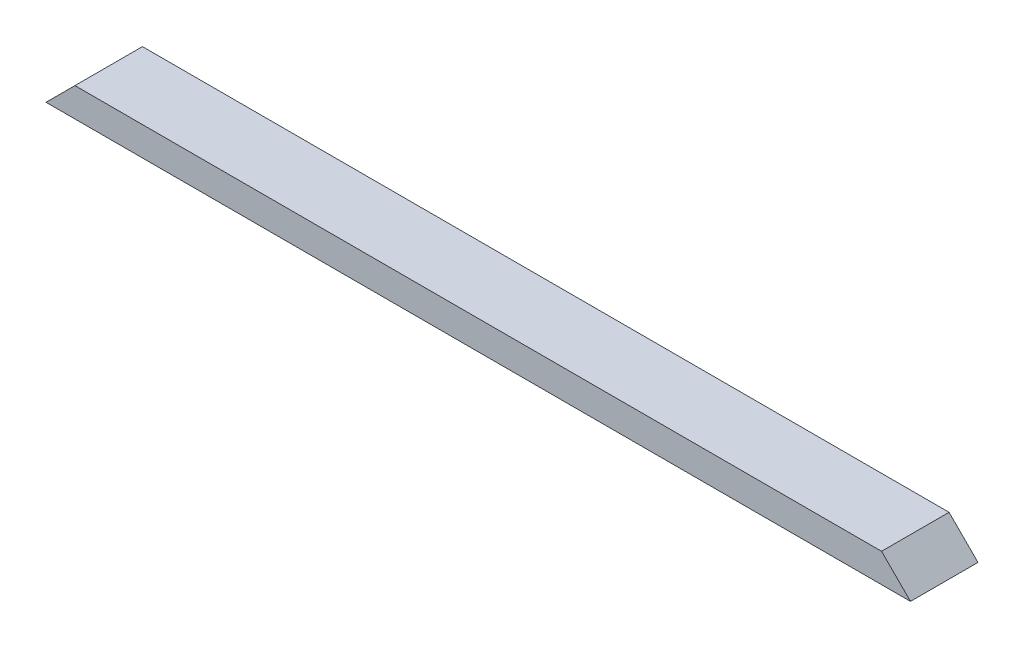
ISO-10303-21;
HEADER;
FILE_DESCRIPTION(('STEP AP214'),'2;1');
FILE_NAME('part.step','',(''),(''),'','','');
FILE_SCHEMA(('AUTOMOTIVE_DESIGN { 1 0 10303 214 1 1 1 1 }'));
ENDSEC;
DATA;
#1=APPLICATION_CONTEXT('core data for automotive mechanical design processes');
#2=APPLICATION_PROTOCOL_DEFINITION('international standard','automotive_design',2000,#1);
#3=PRODUCT_CONTEXT('',#1,'mechanical');
#4=PRODUCT('Part','Part','',(#3));
#5=PRODUCT_RELATED_PRODUCT_CATEGORY('part','',(#4));
#6=PRODUCT_DEFINITION_FORMATION('','',#4);
#7=PRODUCT_DEFINITION_CONTEXT('part definition',#1,'design');
#8=PRODUCT_DEFINITION('design','',#6,#7);
#9=PRODUCT_DEFINITION_SHAPE('','',#8);
#10=(LENGTH_UNIT() NAMED_UNIT(*) SI_UNIT(.MILLI.,.METRE.));
#11=(NAMED_UNIT(*) PLANE_ANGLE_UNIT() SI_UNIT($,.RADIAN.));
#12=(NAMED_UNIT(*) SI_UNIT($,.STERADIAN.) SOLID_ANGLE_UNIT());
#13=UNCERTAINTY_MEASURE_WITH_UNIT(LENGTH_MEASURE(1.E-05),#10,'distance_accuracy_value','');
#14=(GEOMETRIC_REPRESENTATION_CONTEXT(3) GLOBAL_UNCERTAINTY_ASSIGNED_CONTEXT((#13)) GLOBAL_UNIT_ASSIGNED_CONTEXT((#10,
#11,#12)) REPRESENTATION_CONTEXT('',''));
#15=CARTESIAN_POINT('',(0.,0.,0.));
#16=DIRECTION('',(0.,0.,1.));
#17=DIRECTION('',(1.,0.,0.));
#18=AXIS2_PLACEMENT_3D('',#15,#16,#17);
#19=CARTESIAN_POINT('',(0.,38.1,0.));
#20=DIRECTION('',(0.,0.,-1.));
#21=DIRECTION('',(-1.,0.,0.));
#22=AXIS2_PLACEMENT_3D('',#19,#20,#21);
#23=PLANE('',#22);
#24=DIRECTION('',(1.,0.,0.));
#25=VECTOR('',#24,1.);
#26=CARTESIAN_POINT('',(0.,38.1,0.));
#27=LINE('',#26,#25);
#28=CARTESIAN_POINT('',(38.1,38.1,0.));
#29=VERTEX_POINT('',#28);
#30=CARTESIAN_POINT('',(1100.1375,38.1,0.));
#31=VERTEX_POINT('',#30);
#32=EDGE_CURVE('E47',#29,#31,#27,.T.);
#33=ORIENTED_EDGE('',*,*,#32,.F.);
#34=DIRECTION('',(0.707106781186547,0.707106781186547,0.));
#35=VECTOR('',#34,1.);
#36=CARTESIAN_POINT('',(0.,0.,0.));
#37=LINE('',#36,#35);
#38=CARTESIAN_POINT('',(0.,0.,0.));
#39=VERTEX_POINT('',#38);
#40=EDGE_CURVE('E82',#39,#29,#37,.T.);
#41=ORIENTED_EDGE('',*,*,#40,.F.);
#42=DIRECTION('',(1.,0.,0.));
#43=VECTOR('',#42,1.);
#44=CARTESIAN_POINT('',(0.,0.,0.));
#45=LINE('',#44,#43);
#46=CARTESIAN_POINT('',(1138.2375,0.,0.));
#47=VERTEX_POINT('',#46);
#48=EDGE_CURVE('E87',#39,#47,#45,.T.);
#49=ORIENTED_EDGE('',*,*,#48,.T.);
#50=DIRECTION('',(0.707106781186548,-0.707106781186547,0.));
#51=VECTOR('',#50,1.);
#52=CARTESIAN_POINT('',(1100.1375,38.1,0.));
#53=LINE('',#52,#51);
#54=EDGE_CURVE('E63',#31,#47,#53,.T.);
#55=ORIENTED_EDGE('',*,*,#54,.F.);
#56=EDGE_LOOP('',(#33,#41,#49,#55));
#57=FACE_BOUND('',#56,.T.);
#58=ADVANCED_FACE('F39',(#57),#23,.F.);
#59=CARTESIAN_POINT('',(0.,38.1,-88.9));
#60=DIRECTION('',(0.,0.,1.));
#61=DIRECTION('',(1.,0.,0.));
#62=AXIS2_PLACEMENT_3D('',#59,#60,#61);
#63=PLANE('',#62);
#64=DIRECTION('',(-1.,0.,0.));
#65=VECTOR('',#64,1.);
#66=CARTESIAN_POINT('',(0.,0.,-88.9));
#67=LINE('',#66,#65);
#68=CARTESIAN_POINT('',(1138.2375,0.,-88.9));
#69=VERTEX_POINT('',#68);
#70=CARTESIAN_POINT('',(0.,0.,-88.9));
#71=VERTEX_POINT('',#70);
#72=EDGE_CURVE('E42',#69,#71,#67,.T.);
#73=ORIENTED_EDGE('',*,*,#72,.T.);
#74=DIRECTION('',(0.707106781186547,0.707106781186547,0.));
#75=VECTOR('',#74,1.);
#76=CARTESIAN_POINT('',(0.,0.,-88.9));
#77=LINE('',#76,#75);
#78=CARTESIAN_POINT('',(38.1,38.1,-88.9));
#79=VERTEX_POINT('',#78);
#80=EDGE_CURVE('E55',#71,#79,#77,.T.);
#81=ORIENTED_EDGE('',*,*,#80,.T.);
#82=DIRECTION('',(-1.,0.,0.));
#83=VECTOR('',#82,1.);
#84=CARTESIAN_POINT('',(0.,38.1,-88.9));
#85=LINE('',#84,#83);
#86=CARTESIAN_POINT('',(1100.1375,38.1,-88.9));
#87=VERTEX_POINT('',#86);
#88=EDGE_CURVE('E11',#87,#79,#85,.T.);
#89=ORIENTED_EDGE('',*,*,#88,.F.);
#90=DIRECTION('',(0.707106781186548,-0.707106781186547,0.));
#91=VECTOR('',#90,1.);
#92=CARTESIAN_POINT('',(1100.1375,38.1,-88.9));
#93=LINE('',#92,#91);
#94=EDGE_CURVE('E100',#87,#69,#93,.T.);
#95=ORIENTED_EDGE('',*,*,#94,.T.);
#96=EDGE_LOOP('',(#73,#81,#89,#95));
#97=FACE_BOUND('',#96,.T.);
#98=ADVANCED_FACE('F109',(#97),#63,.F.);
#99=CARTESIAN_POINT('',(0.,38.1,0.));
#100=DIRECTION('',(0.,-1.,0.));
#101=DIRECTION('',(0.,0.,-1.));
#102=AXIS2_PLACEMENT_3D('',#99,#100,#101);
#103=PLANE('',#102);
#104=ORIENTED_EDGE('',*,*,#88,.T.);
#105=DIRECTION('',(0.,0.,1.));
#106=VECTOR('',#105,1.);
#107=CARTESIAN_POINT('',(38.1,38.1,-88.9));
#108=LINE('',#107,#106);
#109=EDGE_CURVE('E88',#79,#29,#108,.T.);
#110=ORIENTED_EDGE('',*,*,#109,.T.);
#111=ORIENTED_EDGE('',*,*,#32,.T.);
#112=DIRECTION('',(0.,0.,1.));
#113=VECTOR('',#112,1.);
#114=CARTESIAN_POINT('',(1100.1375,38.1,-88.9));
#115=LINE('',#114,#113);
#116=EDGE_CURVE('E103',#87,#31,#115,.T.);
#117=ORIENTED_EDGE('',*,*,#116,.F.);
#118=EDGE_LOOP('',(#104,#110,#111,#117));
#119=FACE_BOUND('',#118,.T.);
#120=ADVANCED_FACE('F112',(#119),#103,.F.);
#121=CARTESIAN_POINT('',(0.,0.,0.));
#122=DIRECTION('',(0.,-1.,0.));
#123=DIRECTION('',(0.,0.,-1.));
#124=AXIS2_PLACEMENT_3D('',#121,#122,#123);
#125=PLANE('',#124);
#126=DIRECTION('',(0.,0.,1.));
#127=VECTOR('',#126,1.);
#128=CARTESIAN_POINT('',(0.,0.,0.));
#129=LINE('',#128,#127);
#130=EDGE_CURVE('E79',#71,#39,#129,.T.);
#131=ORIENTED_EDGE('',*,*,#130,.F.);
#132=ORIENTED_EDGE('',*,*,#72,.F.);
#133=DIRECTION('',(0.,0.,-1.));
#134=VECTOR('',#133,1.);
#135=CARTESIAN_POINT('',(1138.2375,0.,0.));
#136=LINE('',#135,#134);
#137=EDGE_CURVE('E96',#47,#69,#136,.T.);
#138=ORIENTED_EDGE('',*,*,#137,.F.);
#139=ORIENTED_EDGE('',*,*,#48,.F.);
#140=EDGE_LOOP('',(#131,#132,#138,#139));
#141=FACE_BOUND('',#140,.T.);
#142=ADVANCED_FACE('F95',(#141),#125,.T.);
#143=CARTESIAN_POINT('',(1100.1375,38.1,-88.9));
#144=DIRECTION('',(-0.707106781186547,-0.707106781186548,0.));
#145=DIRECTION('',(0.707106781186548,-0.707106781186547,0.));
#146=AXIS2_PLACEMENT_3D('',#143,#144,#145);
#147=PLANE('',#146);
#148=ORIENTED_EDGE('',*,*,#54,.T.);
#149=ORIENTED_EDGE('',*,*,#137,.T.);
#150=ORIENTED_EDGE('',*,*,#94,.F.);
#151=ORIENTED_EDGE('',*,*,#116,.T.);
#152=EDGE_LOOP('',(#148,#149,#150,#151));
#153=FACE_BOUND('',#152,.T.);
#154=ADVANCED_FACE('F113',(#153),#147,.F.);
#155=CARTESIAN_POINT('',(0.,0.,-88.9));
#156=DIRECTION('',(0.707106781186547,-0.707106781186547,0.));
#157=DIRECTION('',(0.707106781186548,0.707106781186548,0.));
#158=AXIS2_PLACEMENT_3D('',#155,#156,#157);
#159=PLANE('',#158);
#160=ORIENTED_EDGE('',*,*,#40,.T.);
#161=ORIENTED_EDGE('',*,*,#109,.F.);
#162=ORIENTED_EDGE('',*,*,#80,.F.);
#163=ORIENTED_EDGE('',*,*,#130,.T.);
#164=EDGE_LOOP('',(#160,#161,#162,#163));
#165=FACE_BOUND('',#164,.T.);
#166=ADVANCED_FACE('F81',(#165),#159,.F.);
#167=CLOSED_SHELL('',(#58,#98,#120,#142,#154,#166));
#168=MANIFOLD_SOLID_BREP('B2',#167);
#169=ADVANCED_BREP_SHAPE_REPRESENTATION('',(#18,#168),#14);
#170=SHAPE_DEFINITION_REPRESENTATION(#9,#169);
ENDSEC;
END-ISO-10303-21;
